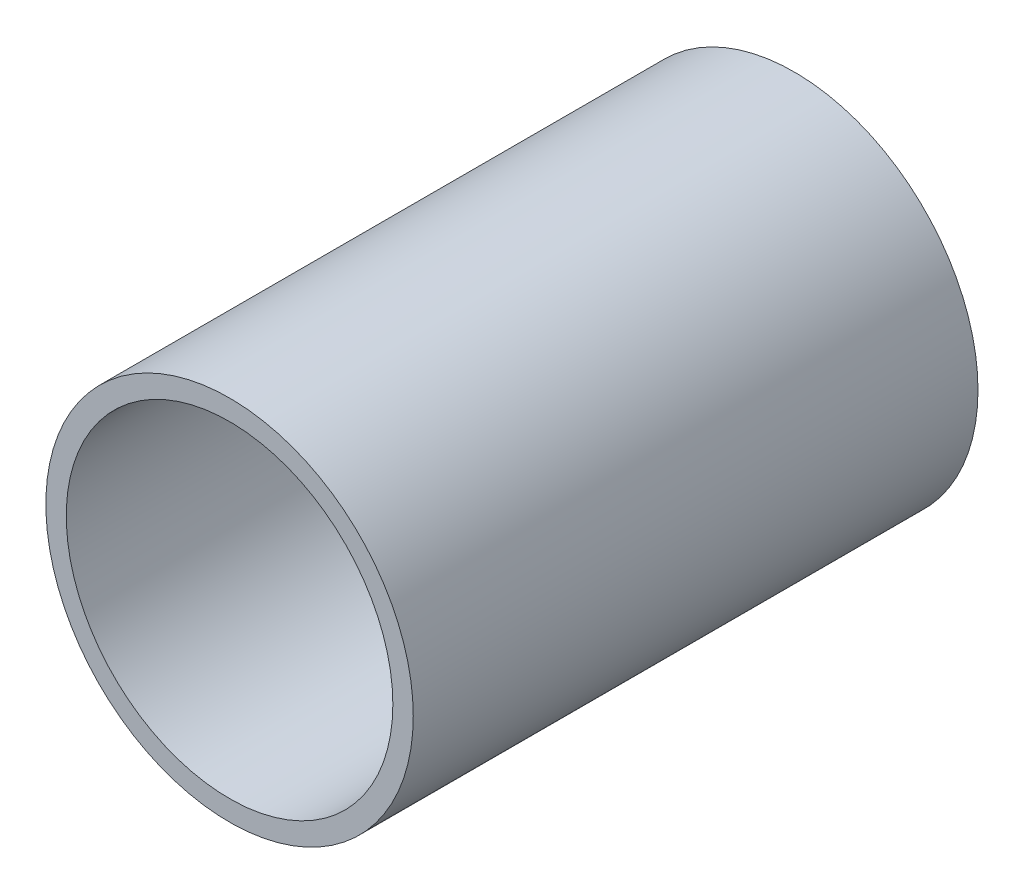
ISO-10303-21;
HEADER;
FILE_DESCRIPTION(('STEP AP214'),'2;1');
FILE_NAME('part.step','',(''),(''),'','','');
FILE_SCHEMA(('AUTOMOTIVE_DESIGN { 1 0 10303 214 1 1 1 1 }'));
ENDSEC;
DATA;
#1=APPLICATION_CONTEXT('core data for automotive mechanical design processes');
#2=APPLICATION_PROTOCOL_DEFINITION('international standard','automotive_design',2000,#1);
#3=PRODUCT_CONTEXT('',#1,'mechanical');
#4=PRODUCT('Part','Part','',(#3));
#5=PRODUCT_RELATED_PRODUCT_CATEGORY('part','',(#4));
#6=PRODUCT_DEFINITION_FORMATION('','',#4);
#7=PRODUCT_DEFINITION_CONTEXT('part definition',#1,'design');
#8=PRODUCT_DEFINITION('design','',#6,#7);
#9=PRODUCT_DEFINITION_SHAPE('','',#8);
#10=(LENGTH_UNIT() NAMED_UNIT(*) SI_UNIT(.MILLI.,.METRE.));
#11=(NAMED_UNIT(*) PLANE_ANGLE_UNIT() SI_UNIT($,.RADIAN.));
#12=(NAMED_UNIT(*) SI_UNIT($,.STERADIAN.) SOLID_ANGLE_UNIT());
#13=UNCERTAINTY_MEASURE_WITH_UNIT(LENGTH_MEASURE(1.E-05),#10,'distance_accuracy_value','');
#14=(GEOMETRIC_REPRESENTATION_CONTEXT(3) GLOBAL_UNCERTAINTY_ASSIGNED_CONTEXT((#13)) GLOBAL_UNIT_ASSIGNED_CONTEXT((#10,
#11,#12)) REPRESENTATION_CONTEXT('',''));
#15=CARTESIAN_POINT('',(0.,0.,0.));
#16=DIRECTION('',(0.,0.,1.));
#17=DIRECTION('',(1.,0.,0.));
#18=AXIS2_PLACEMENT_3D('',#15,#16,#17);
#19=CARTESIAN_POINT('',(0.,0.,41.5));
#20=DIRECTION('',(0.,0.,1.));
#21=DIRECTION('',(1.,0.,0.));
#22=AXIS2_PLACEMENT_3D('',#19,#20,#21);
#23=PLANE('',#22);
#24=CARTESIAN_POINT('',(0.,0.,41.5));
#25=DIRECTION('',(0.,0.,1.));
#26=DIRECTION('',(1.,0.,0.));
#27=AXIS2_PLACEMENT_3D('',#24,#25,#26);
#28=CIRCLE('',#27,13.5);
#29=CARTESIAN_POINT('',(13.5,0.,41.5));
#30=VERTEX_POINT('',#29);
#31=EDGE_CURVE('E10',#30,#30,#28,.T.);
#32=ORIENTED_EDGE('',*,*,#31,.T.);
#33=EDGE_LOOP('',(#32));
#34=FACE_BOUND('',#33,.T.);
#35=CARTESIAN_POINT('',(0.,0.,41.5));
#36=DIRECTION('',(0.,0.,1.));
#37=DIRECTION('',(1.,0.,0.));
#38=AXIS2_PLACEMENT_3D('',#35,#36,#37);
#39=CIRCLE('',#38,12.);
#40=CARTESIAN_POINT('',(12.,0.,41.5));
#41=VERTEX_POINT('',#40);
#42=EDGE_CURVE('E50',#41,#41,#39,.T.);
#43=ORIENTED_EDGE('',*,*,#42,.F.);
#44=EDGE_LOOP('',(#43));
#45=FACE_BOUND('',#44,.T.);
#46=ADVANCED_FACE('F37',(#34,#45),#23,.T.);
#47=CARTESIAN_POINT('',(0.,0.,0.));
#48=DIRECTION('',(0.,0.,1.));
#49=DIRECTION('',(1.,0.,0.));
#50=AXIS2_PLACEMENT_3D('',#47,#48,#49);
#51=PLANE('',#50);
#52=CARTESIAN_POINT('',(0.,0.,0.));
#53=DIRECTION('',(0.,0.,1.));
#54=DIRECTION('',(1.,0.,0.));
#55=AXIS2_PLACEMENT_3D('',#52,#53,#54);
#56=CIRCLE('',#55,13.5);
#57=CARTESIAN_POINT('',(13.5,0.,0.));
#58=VERTEX_POINT('',#57);
#59=EDGE_CURVE('E41',#58,#58,#56,.T.);
#60=ORIENTED_EDGE('',*,*,#59,.F.);
#61=EDGE_LOOP('',(#60));
#62=FACE_BOUND('',#61,.T.);
#63=CARTESIAN_POINT('',(0.,0.,0.));
#64=DIRECTION('',(0.,0.,1.));
#65=DIRECTION('',(1.,0.,0.));
#66=AXIS2_PLACEMENT_3D('',#63,#64,#65);
#67=CIRCLE('',#66,12.);
#68=CARTESIAN_POINT('',(12.,0.,0.));
#69=VERTEX_POINT('',#68);
#70=EDGE_CURVE('E52',#69,#69,#67,.T.);
#71=ORIENTED_EDGE('',*,*,#70,.T.);
#72=EDGE_LOOP('',(#71));
#73=FACE_BOUND('',#72,.T.);
#74=ADVANCED_FACE('F64',(#62,#73),#51,.F.);
#75=CARTESIAN_POINT('',(0.,0.,41.5));
#76=DIRECTION('',(0.,0.,-1.));
#77=DIRECTION('',(-1.,0.,0.));
#78=AXIS2_PLACEMENT_3D('',#75,#76,#77);
#79=CYLINDRICAL_SURFACE('',#78,13.5);
#80=ORIENTED_EDGE('',*,*,#31,.F.);
#81=EDGE_LOOP('',(#80));
#82=FACE_BOUND('',#81,.T.);
#83=ORIENTED_EDGE('',*,*,#59,.T.);
#84=EDGE_LOOP('',(#83));
#85=FACE_BOUND('',#84,.T.);
#86=ADVANCED_FACE('F39',(#82,#85),#79,.T.);
#87=CARTESIAN_POINT('',(0.,0.,41.5));
#88=DIRECTION('',(0.,0.,-1.));
#89=DIRECTION('',(-1.,0.,0.));
#90=AXIS2_PLACEMENT_3D('',#87,#88,#89);
#91=CYLINDRICAL_SURFACE('',#90,12.);
#92=ORIENTED_EDGE('',*,*,#42,.T.);
#93=EDGE_LOOP('',(#92));
#94=FACE_BOUND('',#93,.T.);
#95=ORIENTED_EDGE('',*,*,#70,.F.);
#96=EDGE_LOOP('',(#95));
#97=FACE_BOUND('',#96,.T.);
#98=ADVANCED_FACE('F60',(#94,#97),#91,.F.);
#99=CLOSED_SHELL('',(#46,#74,#86,#98));
#100=MANIFOLD_SOLID_BREP('B2',#99);
#101=ADVANCED_BREP_SHAPE_REPRESENTATION('',(#18,#100),#14);
#102=SHAPE_DEFINITION_REPRESENTATION(#9,#101);
ENDSEC;
END-ISO-10303-21;
